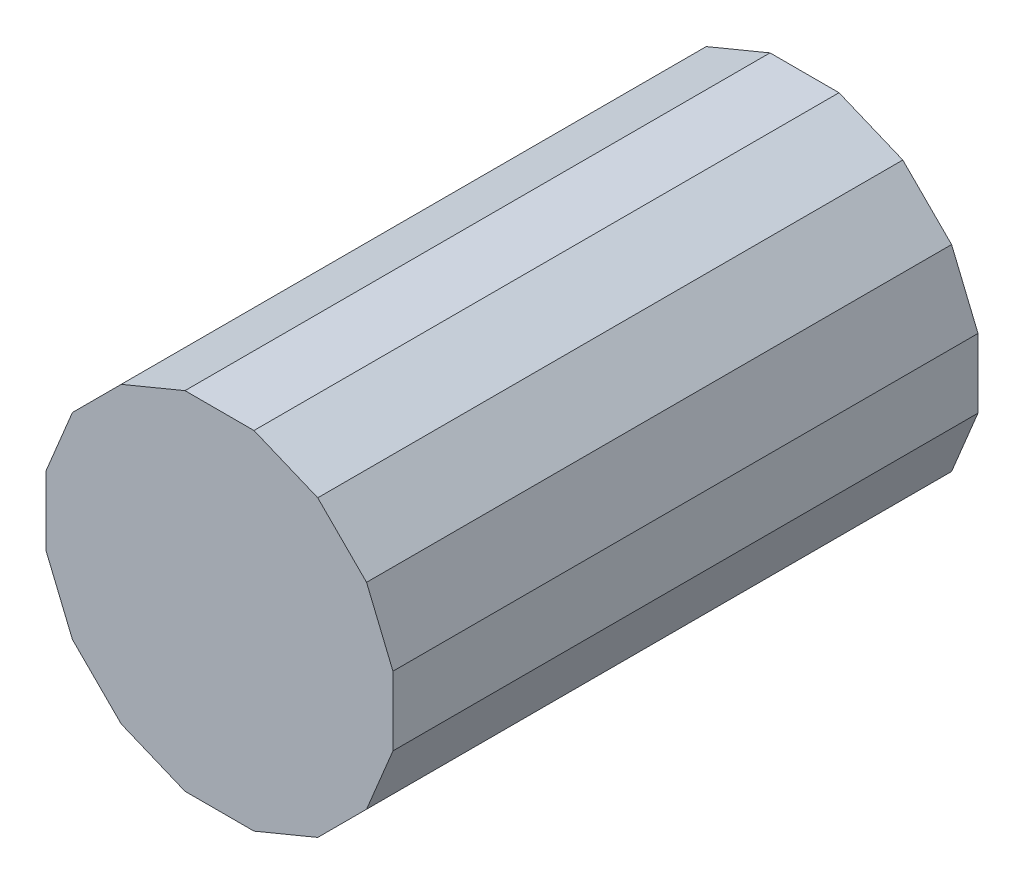
ISO-10303-21;
HEADER;
FILE_DESCRIPTION(('STEP AP214'),'2;1');
FILE_NAME('part.step','',(''),(''),'','','');
FILE_SCHEMA(('AUTOMOTIVE_DESIGN { 1 0 10303 214 1 1 1 1 }'));
ENDSEC;
DATA;
#1=APPLICATION_CONTEXT('core data for automotive mechanical design processes');
#2=APPLICATION_PROTOCOL_DEFINITION('international standard','automotive_design',2000,#1);
#3=PRODUCT_CONTEXT('',#1,'mechanical');
#4=PRODUCT('Part','Part','',(#3));
#5=PRODUCT_RELATED_PRODUCT_CATEGORY('part','',(#4));
#6=PRODUCT_DEFINITION_FORMATION('','',#4);
#7=PRODUCT_DEFINITION_CONTEXT('part definition',#1,'design');
#8=PRODUCT_DEFINITION('design','',#6,#7);
#9=PRODUCT_DEFINITION_SHAPE('','',#8);
#10=(LENGTH_UNIT() NAMED_UNIT(*) SI_UNIT(.MILLI.,.METRE.));
#11=(NAMED_UNIT(*) PLANE_ANGLE_UNIT() SI_UNIT($,.RADIAN.));
#12=(NAMED_UNIT(*) SI_UNIT($,.STERADIAN.) SOLID_ANGLE_UNIT());
#13=UNCERTAINTY_MEASURE_WITH_UNIT(LENGTH_MEASURE(1.E-05),#10,'distance_accuracy_value','');
#14=(GEOMETRIC_REPRESENTATION_CONTEXT(3) GLOBAL_UNCERTAINTY_ASSIGNED_CONTEXT((#13)) GLOBAL_UNIT_ASSIGNED_CONTEXT((#10,
#11,#12)) REPRESENTATION_CONTEXT('',''));
#15=CARTESIAN_POINT('',(0.,0.,0.));
#16=DIRECTION('',(0.,0.,1.));
#17=DIRECTION('',(1.,0.,0.));
#18=AXIS2_PLACEMENT_3D('',#15,#16,#17);
#19=CARTESIAN_POINT('',(-6.703377361718E-07,-6.703377413164E-07,1.00999798));
#20=DIRECTION('',(0.,0.,-1.));
#21=DIRECTION('',(-1.,0.,0.));
#22=AXIS2_PLACEMENT_3D('',#19,#20,#21);
#23=PLANE('',#22);
#24=DIRECTION('',(0.923885359866117,0.382669363583049,0.));
#25=VECTOR('',#24,1.);
#26=CARTESIAN_POINT('',(0.1696466,-0.2538984,1.00999798));
#27=LINE('',#26,#25);
#28=CARTESIAN_POINT('',(0.1696466,-0.2538984,1.00999798));
#29=VERTEX_POINT('',#28);
#30=CARTESIAN_POINT('',(0.0595706200000009,-0.299491400000002,1.00999798));
#31=VERTEX_POINT('',#30);
#32=EDGE_CURVE('E157',#29,#31,#27,.F.);
#33=ORIENTED_EDGE('',*,*,#32,.F.);
#34=DIRECTION('',(0.707106781186548,0.707106781186548,0.));
#35=VECTOR('',#34,1.);
#36=CARTESIAN_POINT('',(0.25389586,-0.16964914,1.00999798));
#37=LINE('',#36,#35);
#38=CARTESIAN_POINT('',(0.253895859999986,-0.169649139999994,1.00999798));
#39=VERTEX_POINT('',#38);
#40=EDGE_CURVE('E162',#39,#29,#37,.F.);
#41=ORIENTED_EDGE('',*,*,#40,.F.);
#42=DIRECTION('',(0.382687560176932,0.923877822704835,0.));
#43=VECTOR('',#42,1.);
#44=CARTESIAN_POINT('',(0.2994914,-0.05957316000001,1.00999798));
#45=LINE('',#44,#43);
#46=CARTESIAN_POINT('',(0.2994914,-0.05957316000001,1.00999798));
#47=VERTEX_POINT('',#46);
#48=EDGE_CURVE('E167',#47,#39,#45,.F.);
#49=ORIENTED_EDGE('',*,*,#48,.F.);
#50=DIRECTION('',(0.,1.,0.));
#51=VECTOR('',#50,1.);
#52=CARTESIAN_POINT('',(0.2994914,0.,1.00999798));
#53=LINE('',#52,#51);
#54=CARTESIAN_POINT('',(0.299491400000015,0.0595706200000064,1.00999798));
#55=VERTEX_POINT('',#54);
#56=EDGE_CURVE('E172',#55,#47,#53,.F.);
#57=ORIENTED_EDGE('',*,*,#56,.F.);
#58=DIRECTION('',(-0.382687560176932,0.923877822704835,0.));
#59=VECTOR('',#58,1.);
#60=CARTESIAN_POINT('',(0.25389586,0.1696466,1.00999798));
#61=LINE('',#60,#59);
#62=CARTESIAN_POINT('',(0.25389586,0.1696466,1.00999798));
#63=VERTEX_POINT('',#62);
#64=EDGE_CURVE('E177',#63,#55,#61,.F.);
#65=ORIENTED_EDGE('',*,*,#64,.F.);
#66=DIRECTION('',(-0.707106781186548,0.707106781186548,0.));
#67=VECTOR('',#66,1.);
#68=CARTESIAN_POINT('',(0.1696466,0.25389586,1.00999798));
#69=LINE('',#68,#67);
#70=CARTESIAN_POINT('',(0.169646599999994,0.253895859999984,1.00999798));
#71=VERTEX_POINT('',#70);
#72=EDGE_CURVE('E183',#71,#63,#69,.F.);
#73=ORIENTED_EDGE('',*,*,#72,.F.);
#74=DIRECTION('',(-0.923877822704835,0.382687560176932,0.));
#75=VECTOR('',#74,1.);
#76=CARTESIAN_POINT('',(0.05957062,0.2994914,1.00999798));
#77=LINE('',#76,#75);
#78=CARTESIAN_POINT('',(0.05957062,0.2994914,1.00999798));
#79=VERTEX_POINT('',#78);
#80=EDGE_CURVE('E188',#79,#71,#77,.F.);
#81=ORIENTED_EDGE('',*,*,#80,.F.);
#82=DIRECTION('',(1.,0.,0.));
#83=VECTOR('',#82,1.);
#84=CARTESIAN_POINT('',(0.,0.2994914,1.00999798));
#85=LINE('',#84,#83);
#86=CARTESIAN_POINT('',(-0.0595731600000157,0.299491400000014,1.00999798));
#87=VERTEX_POINT('',#86);
#88=EDGE_CURVE('E193',#87,#79,#85,.T.);
#89=ORIENTED_EDGE('',*,*,#88,.F.);
#90=DIRECTION('',(-0.923877822704835,-0.382687560176932,0.));
#91=VECTOR('',#90,1.);
#92=CARTESIAN_POINT('',(-0.16964914,0.25389586,1.00999798));
#93=LINE('',#92,#91);
#94=CARTESIAN_POINT('',(-0.16964914,0.25389586,1.00999798));
#95=VERTEX_POINT('',#94);
#96=EDGE_CURVE('E198',#95,#87,#93,.F.);
#97=ORIENTED_EDGE('',*,*,#96,.F.);
#98=DIRECTION('',(-0.707106781186548,-0.707106781186548,0.));
#99=VECTOR('',#98,1.);
#100=CARTESIAN_POINT('',(-0.2538984,0.1696466,1.00999798));
#101=LINE('',#100,#99);
#102=CARTESIAN_POINT('',(-0.253898399999998,0.169646599999999,1.00999798));
#103=VERTEX_POINT('',#102);
#104=EDGE_CURVE('E204',#103,#95,#101,.F.);
#105=ORIENTED_EDGE('',*,*,#104,.F.);
#106=DIRECTION('',(-0.382669363583049,-0.923885359866117,0.));
#107=VECTOR('',#106,1.);
#108=CARTESIAN_POINT('',(-0.2994914,0.05957062,1.00999798));
#109=LINE('',#108,#107);
#110=CARTESIAN_POINT('',(-0.2994914,0.05957062,1.00999798));
#111=VERTEX_POINT('',#110);
#112=EDGE_CURVE('E209',#111,#103,#109,.F.);
#113=ORIENTED_EDGE('',*,*,#112,.F.);
#114=DIRECTION('',(0.,1.,0.));
#115=VECTOR('',#114,1.);
#116=CARTESIAN_POINT('',(-0.2994914,0.,1.00999798));
#117=LINE('',#116,#115);
#118=CARTESIAN_POINT('',(-0.2994914,-0.0595731600000101,1.00999798));
#119=VERTEX_POINT('',#118);
#120=EDGE_CURVE('E214',#119,#111,#117,.T.);
#121=ORIENTED_EDGE('',*,*,#120,.F.);
#122=DIRECTION('',(0.382669363583049,-0.923885359866117,0.));
#123=VECTOR('',#122,1.);
#124=CARTESIAN_POINT('',(-0.2538984,-0.16964914,1.00999798));
#125=LINE('',#124,#123);
#126=CARTESIAN_POINT('',(-0.2538984,-0.16964914,1.00999798));
#127=VERTEX_POINT('',#126);
#128=EDGE_CURVE('E219',#127,#119,#125,.F.);
#129=ORIENTED_EDGE('',*,*,#128,.F.);
#130=DIRECTION('',(0.707106781186548,-0.707106781186548,0.));
#131=VECTOR('',#130,1.);
#132=CARTESIAN_POINT('',(-0.16964914,-0.2538984,1.00999798));
#133=LINE('',#132,#131);
#134=CARTESIAN_POINT('',(-0.16964914,-0.2538984,1.00999798));
#135=VERTEX_POINT('',#134);
#136=EDGE_CURVE('E139',#135,#127,#133,.F.);
#137=ORIENTED_EDGE('',*,*,#136,.F.);
#138=DIRECTION('',(0.923885359866117,-0.382669363583049,0.));
#139=VECTOR('',#138,1.);
#140=CARTESIAN_POINT('',(-0.05957316000001,-0.2994914,1.00999798));
#141=LINE('',#140,#139);
#142=CARTESIAN_POINT('',(-0.05957316000001,-0.2994914,1.00999798));
#143=VERTEX_POINT('',#142);
#144=EDGE_CURVE('E127',#143,#135,#141,.F.);
#145=ORIENTED_EDGE('',*,*,#144,.F.);
#146=DIRECTION('',(1.,0.,0.));
#147=VECTOR('',#146,1.);
#148=CARTESIAN_POINT('',(0.05957062,-0.2994914,1.00999798));
#149=LINE('',#148,#147);
#150=EDGE_CURVE('E131',#31,#143,#149,.F.);
#151=ORIENTED_EDGE('',*,*,#150,.F.);
#152=EDGE_LOOP('',(#33,#41,#49,#57,#65,#73,#81,#89,#97,#105,#113,#121,#129,#137,#145,#151));
#153=FACE_BOUND('',#152,.T.);
#154=ADVANCED_FACE('F17',(#153),#23,.F.);
#155=CARTESIAN_POINT('',(-0.05957316000001,-0.2994914,0.));
#156=DIRECTION('',(-0.382669363583049,-0.923885359866117,0.));
#157=DIRECTION('',(0.923885359866117,-0.382669363583049,0.));
#158=AXIS2_PLACEMENT_3D('',#155,#156,#157);
#159=PLANE('',#158);
#160=DIRECTION('',(0.,0.,1.));
#161=VECTOR('',#160,1.);
#162=CARTESIAN_POINT('',(-0.16964914,-0.2538984,0.));
#163=LINE('',#162,#161);
#164=CARTESIAN_POINT('',(-0.16964914,-0.2538984,0.));
#165=VERTEX_POINT('',#164);
#166=EDGE_CURVE('E141',#165,#135,#163,.T.);
#167=ORIENTED_EDGE('',*,*,#166,.F.);
#168=DIRECTION('',(-0.923885359866119,0.382669363583043,0.));
#169=VECTOR('',#168,1.);
#170=CARTESIAN_POINT('',(-0.05957316000001,-0.2994914,0.));
#171=LINE('',#170,#169);
#172=CARTESIAN_POINT('',(-0.05957316000001,-0.2994914,0.));
#173=VERTEX_POINT('',#172);
#174=EDGE_CURVE('E144',#173,#165,#171,.T.);
#175=ORIENTED_EDGE('',*,*,#174,.F.);
#176=DIRECTION('',(0.,0.,1.));
#177=VECTOR('',#176,1.);
#178=CARTESIAN_POINT('',(-0.05957316000001,-0.2994914,0.));
#179=LINE('',#178,#177);
#180=EDGE_CURVE('E20',#173,#143,#179,.T.);
#181=ORIENTED_EDGE('',*,*,#180,.T.);
#182=ORIENTED_EDGE('',*,*,#144,.T.);
#183=EDGE_LOOP('',(#167,#175,#181,#182));
#184=FACE_BOUND('',#183,.T.);
#185=ADVANCED_FACE('F142',(#184),#159,.T.);
#186=CARTESIAN_POINT('',(-0.16964914,-0.2538984,0.));
#187=DIRECTION('',(-0.707106781186548,-0.707106781186548,0.));
#188=DIRECTION('',(0.707106781186548,-0.707106781186548,0.));
#189=AXIS2_PLACEMENT_3D('',#186,#187,#188);
#190=PLANE('',#189);
#191=DIRECTION('',(0.,0.,1.));
#192=VECTOR('',#191,1.);
#193=CARTESIAN_POINT('',(-0.2538984,-0.16964914,0.));
#194=LINE('',#193,#192);
#195=CARTESIAN_POINT('',(-0.2538984,-0.16964914,0.));
#196=VERTEX_POINT('',#195);
#197=EDGE_CURVE('E222',#196,#127,#194,.T.);
#198=ORIENTED_EDGE('',*,*,#197,.F.);
#199=DIRECTION('',(-0.707106781186547,0.707106781186547,0.));
#200=VECTOR('',#199,1.);
#201=CARTESIAN_POINT('',(-0.16964914,-0.2538984,0.));
#202=LINE('',#201,#200);
#203=EDGE_CURVE('E148',#165,#196,#202,.T.);
#204=ORIENTED_EDGE('',*,*,#203,.F.);
#205=ORIENTED_EDGE('',*,*,#166,.T.);
#206=ORIENTED_EDGE('',*,*,#136,.T.);
#207=EDGE_LOOP('',(#198,#204,#205,#206));
#208=FACE_BOUND('',#207,.T.);
#209=ADVANCED_FACE('F227',(#208),#190,.T.);
#210=CARTESIAN_POINT('',(-0.2538984,-0.16964914,0.));
#211=DIRECTION('',(-0.923885359866117,-0.382669363583049,0.));
#212=DIRECTION('',(0.382669363583049,-0.923885359866117,0.));
#213=AXIS2_PLACEMENT_3D('',#210,#211,#212);
#214=PLANE('',#213);
#215=DIRECTION('',(0.,0.,1.));
#216=VECTOR('',#215,1.);
#217=CARTESIAN_POINT('',(-0.2994914,-0.05957316000001,0.));
#218=LINE('',#217,#216);
#219=CARTESIAN_POINT('',(-0.2994914,-0.0595731600000101,0.));
#220=VERTEX_POINT('',#219);
#221=EDGE_CURVE('E216',#220,#119,#218,.T.);
#222=ORIENTED_EDGE('',*,*,#221,.F.);
#223=DIRECTION('',(-0.382669363583043,0.923885359866119,0.));
#224=VECTOR('',#223,1.);
#225=CARTESIAN_POINT('',(-0.2538984,-0.16964914,0.));
#226=LINE('',#225,#224);
#227=EDGE_CURVE('E230',#196,#220,#226,.T.);
#228=ORIENTED_EDGE('',*,*,#227,.F.);
#229=ORIENTED_EDGE('',*,*,#197,.T.);
#230=ORIENTED_EDGE('',*,*,#128,.T.);
#231=EDGE_LOOP('',(#222,#228,#229,#230));
#232=FACE_BOUND('',#231,.T.);
#233=ADVANCED_FACE('F307',(#232),#214,.T.);
#234=CARTESIAN_POINT('',(-0.2994914,0.,0.));
#235=DIRECTION('',(-1.,0.,0.));
#236=DIRECTION('',(0.,0.,1.));
#237=AXIS2_PLACEMENT_3D('',#234,#235,#236);
#238=PLANE('',#237);
#239=DIRECTION('',(0.,0.,1.));
#240=VECTOR('',#239,1.);
#241=CARTESIAN_POINT('',(-0.2994914,0.05957062,0.));
#242=LINE('',#241,#240);
#243=CARTESIAN_POINT('',(-0.2994914,0.05957062,0.));
#244=VERTEX_POINT('',#243);
#245=EDGE_CURVE('E211',#244,#111,#242,.T.);
#246=ORIENTED_EDGE('',*,*,#245,.F.);
#247=DIRECTION('',(0.,1.,0.));
#248=VECTOR('',#247,1.);
#249=CARTESIAN_POINT('',(-0.2994914,-6.703377413164E-07,0.));
#250=LINE('',#249,#248);
#251=EDGE_CURVE('E231',#220,#244,#250,.T.);
#252=ORIENTED_EDGE('',*,*,#251,.F.);
#253=ORIENTED_EDGE('',*,*,#221,.T.);
#254=ORIENTED_EDGE('',*,*,#120,.T.);
#255=EDGE_LOOP('',(#246,#252,#253,#254));
#256=FACE_BOUND('',#255,.T.);
#257=ADVANCED_FACE('F305',(#256),#238,.T.);
#258=CARTESIAN_POINT('',(-0.2994914,0.05957062,0.));
#259=DIRECTION('',(-0.923885359866117,0.382669363583049,0.));
#260=DIRECTION('',(-0.382669363583049,-0.923885359866117,0.));
#261=AXIS2_PLACEMENT_3D('',#258,#259,#260);
#262=PLANE('',#261);
#263=DIRECTION('',(0.,0.,1.));
#264=VECTOR('',#263,1.);
#265=CARTESIAN_POINT('',(-0.2538984,0.1696466,0.));
#266=LINE('',#265,#264);
#267=CARTESIAN_POINT('',(-0.253898399999998,0.169646599999999,0.));
#268=VERTEX_POINT('',#267);
#269=EDGE_CURVE('E206',#268,#103,#266,.T.);
#270=ORIENTED_EDGE('',*,*,#269,.F.);
#271=DIRECTION('',(0.382669363583013,0.923885359866132,0.));
#272=VECTOR('',#271,1.);
#273=CARTESIAN_POINT('',(-0.2994914,0.05957062,0.));
#274=LINE('',#273,#272);
#275=EDGE_CURVE('E235',#244,#268,#274,.T.);
#276=ORIENTED_EDGE('',*,*,#275,.F.);
#277=ORIENTED_EDGE('',*,*,#245,.T.);
#278=ORIENTED_EDGE('',*,*,#112,.T.);
#279=EDGE_LOOP('',(#270,#276,#277,#278));
#280=FACE_BOUND('',#279,.T.);
#281=ADVANCED_FACE('F302',(#280),#262,.T.);
#282=CARTESIAN_POINT('',(-0.2538984,0.1696466,0.));
#283=DIRECTION('',(-0.707106781186548,0.707106781186548,0.));
#284=DIRECTION('',(-0.707106781186548,-0.707106781186548,0.));
#285=AXIS2_PLACEMENT_3D('',#282,#283,#284);
#286=PLANE('',#285);
#287=DIRECTION('',(0.,0.,1.));
#288=VECTOR('',#287,1.);
#289=CARTESIAN_POINT('',(-0.16964914,0.25389586,0.));
#290=LINE('',#289,#288);
#291=CARTESIAN_POINT('',(-0.16964914,0.25389586,0.));
#292=VERTEX_POINT('',#291);
#293=EDGE_CURVE('E201',#292,#95,#290,.T.);
#294=ORIENTED_EDGE('',*,*,#293,.F.);
#295=DIRECTION('',(0.707106781186548,0.707106781186547,0.));
#296=VECTOR('',#295,1.);
#297=CARTESIAN_POINT('',(-0.2538984,0.1696466,0.));
#298=LINE('',#297,#296);
#299=EDGE_CURVE('E238',#268,#292,#298,.T.);
#300=ORIENTED_EDGE('',*,*,#299,.F.);
#301=ORIENTED_EDGE('',*,*,#269,.T.);
#302=ORIENTED_EDGE('',*,*,#104,.T.);
#303=EDGE_LOOP('',(#294,#300,#301,#302));
#304=FACE_BOUND('',#303,.T.);
#305=ADVANCED_FACE('F297',(#304),#286,.T.);
#306=CARTESIAN_POINT('',(-0.16964914,0.25389586,0.));
#307=DIRECTION('',(-0.382687560176932,0.923877822704835,0.));
#308=DIRECTION('',(-0.923877822704835,-0.382687560176932,0.));
#309=AXIS2_PLACEMENT_3D('',#306,#307,#308);
#310=PLANE('',#309);
#311=DIRECTION('',(0.,0.,1.));
#312=VECTOR('',#311,1.);
#313=CARTESIAN_POINT('',(-0.05957316000001,0.2994914,0.));
#314=LINE('',#313,#312);
#315=CARTESIAN_POINT('',(-0.0595731600000157,0.299491400000014,0.));
#316=VERTEX_POINT('',#315);
#317=EDGE_CURVE('E195',#316,#87,#314,.T.);
#318=ORIENTED_EDGE('',*,*,#317,.F.);
#319=DIRECTION('',(0.923877822704931,0.382687560176702,0.));
#320=VECTOR('',#319,1.);
#321=CARTESIAN_POINT('',(-0.16964914,0.25389586,0.));
#322=LINE('',#321,#320);
#323=EDGE_CURVE('E241',#292,#316,#322,.T.);
#324=ORIENTED_EDGE('',*,*,#323,.F.);
#325=ORIENTED_EDGE('',*,*,#293,.T.);
#326=ORIENTED_EDGE('',*,*,#96,.T.);
#327=EDGE_LOOP('',(#318,#324,#325,#326));
#328=FACE_BOUND('',#327,.T.);
#329=ADVANCED_FACE('F293',(#328),#310,.T.);
#330=CARTESIAN_POINT('',(0.,0.2994914,0.));
#331=DIRECTION('',(0.,1.,0.));
#332=DIRECTION('',(0.,0.,1.));
#333=AXIS2_PLACEMENT_3D('',#330,#331,#332);
#334=PLANE('',#333);
#335=DIRECTION('',(0.,0.,1.));
#336=VECTOR('',#335,1.);
#337=CARTESIAN_POINT('',(0.05957062,0.2994914,0.));
#338=LINE('',#337,#336);
#339=CARTESIAN_POINT('',(0.05957062,0.2994914,0.));
#340=VERTEX_POINT('',#339);
#341=EDGE_CURVE('E190',#340,#79,#338,.T.);
#342=ORIENTED_EDGE('',*,*,#341,.F.);
#343=DIRECTION('',(-1.,0.,0.));
#344=VECTOR('',#343,1.);
#345=CARTESIAN_POINT('',(-6.703377361718E-07,0.2994914,0.));
#346=LINE('',#345,#344);
#347=EDGE_CURVE('E244',#316,#340,#346,.F.);
#348=ORIENTED_EDGE('',*,*,#347,.F.);
#349=ORIENTED_EDGE('',*,*,#317,.T.);
#350=ORIENTED_EDGE('',*,*,#88,.T.);
#351=EDGE_LOOP('',(#342,#348,#349,#350));
#352=FACE_BOUND('',#351,.T.);
#353=ADVANCED_FACE('F289',(#352),#334,.T.);
#354=CARTESIAN_POINT('',(0.05957062,0.2994914,0.));
#355=DIRECTION('',(0.382687560176932,0.923877822704835,0.));
#356=DIRECTION('',(-0.923877822704835,0.382687560176932,0.));
#357=AXIS2_PLACEMENT_3D('',#354,#355,#356);
#358=PLANE('',#357);
#359=DIRECTION('',(0.,0.,1.));
#360=VECTOR('',#359,1.);
#361=CARTESIAN_POINT('',(0.1696466,0.25389586,0.));
#362=LINE('',#361,#360);
#363=CARTESIAN_POINT('',(0.169646599999994,0.253895859999984,0.));
#364=VERTEX_POINT('',#363);
#365=EDGE_CURVE('E185',#364,#71,#362,.T.);
#366=ORIENTED_EDGE('',*,*,#365,.F.);
#367=DIRECTION('',(0.923877822704943,-0.382687560176672,0.));
#368=VECTOR('',#367,1.);
#369=CARTESIAN_POINT('',(0.05957062,0.2994914,0.));
#370=LINE('',#369,#368);
#371=EDGE_CURVE('E246',#340,#364,#370,.T.);
#372=ORIENTED_EDGE('',*,*,#371,.F.);
#373=ORIENTED_EDGE('',*,*,#341,.T.);
#374=ORIENTED_EDGE('',*,*,#80,.T.);
#375=EDGE_LOOP('',(#366,#372,#373,#374));
#376=FACE_BOUND('',#375,.T.);
#377=ADVANCED_FACE('F285',(#376),#358,.T.);
#378=CARTESIAN_POINT('',(0.1696466,0.25389586,0.));
#379=DIRECTION('',(0.707106781186548,0.707106781186548,0.));
#380=DIRECTION('',(-0.707106781186548,0.707106781186548,0.));
#381=AXIS2_PLACEMENT_3D('',#378,#379,#380);
#382=PLANE('',#381);
#383=DIRECTION('',(0.,0.,1.));
#384=VECTOR('',#383,1.);
#385=CARTESIAN_POINT('',(0.25389586,0.1696466,0.));
#386=LINE('',#385,#384);
#387=CARTESIAN_POINT('',(0.25389586,0.1696466,0.));
#388=VERTEX_POINT('',#387);
#389=EDGE_CURVE('E180',#388,#63,#386,.T.);
#390=ORIENTED_EDGE('',*,*,#389,.F.);
#391=DIRECTION('',(0.707106781186547,-0.707106781186547,0.));
#392=VECTOR('',#391,1.);
#393=CARTESIAN_POINT('',(0.1696466,0.25389586,0.));
#394=LINE('',#393,#392);
#395=EDGE_CURVE('E249',#364,#388,#394,.T.);
#396=ORIENTED_EDGE('',*,*,#395,.F.);
#397=ORIENTED_EDGE('',*,*,#365,.T.);
#398=ORIENTED_EDGE('',*,*,#72,.T.);
#399=EDGE_LOOP('',(#390,#396,#397,#398));
#400=FACE_BOUND('',#399,.T.);
#401=ADVANCED_FACE('F282',(#400),#382,.T.);
#402=CARTESIAN_POINT('',(0.25389586,0.1696466,0.));
#403=DIRECTION('',(0.923877822704835,0.382687560176932,0.));
#404=DIRECTION('',(-0.382687560176932,0.923877822704835,0.));
#405=AXIS2_PLACEMENT_3D('',#402,#403,#404);
#406=PLANE('',#405);
#407=DIRECTION('',(0.,0.,-1.));
#408=VECTOR('',#407,1.);
#409=CARTESIAN_POINT('',(0.2994914,0.05957062,0.));
#410=LINE('',#409,#408);
#411=CARTESIAN_POINT('',(0.299491400000015,0.0595706200000064,0.));
#412=VERTEX_POINT('',#411);
#413=EDGE_CURVE('E174',#412,#55,#410,.F.);
#414=ORIENTED_EDGE('',*,*,#413,.F.);
#415=DIRECTION('',(0.382687560176672,-0.923877822704943,0.));
#416=VECTOR('',#415,1.);
#417=CARTESIAN_POINT('',(0.25389586,0.1696466,0.));
#418=LINE('',#417,#416);
#419=EDGE_CURVE('E252',#388,#412,#418,.T.);
#420=ORIENTED_EDGE('',*,*,#419,.F.);
#421=ORIENTED_EDGE('',*,*,#389,.T.);
#422=ORIENTED_EDGE('',*,*,#64,.T.);
#423=EDGE_LOOP('',(#414,#420,#421,#422));
#424=FACE_BOUND('',#423,.T.);
#425=ADVANCED_FACE('F277',(#424),#406,.T.);
#426=CARTESIAN_POINT('',(0.2994914,0.,0.));
#427=DIRECTION('',(1.,0.,0.));
#428=DIRECTION('',(0.,0.,-1.));
#429=AXIS2_PLACEMENT_3D('',#426,#427,#428);
#430=PLANE('',#429);
#431=DIRECTION('',(0.,0.,1.));
#432=VECTOR('',#431,1.);
#433=CARTESIAN_POINT('',(0.2994914,-0.05957316000001,0.));
#434=LINE('',#433,#432);
#435=CARTESIAN_POINT('',(0.2994914,-0.05957316000001,0.));
#436=VERTEX_POINT('',#435);
#437=EDGE_CURVE('E169',#436,#47,#434,.T.);
#438=ORIENTED_EDGE('',*,*,#437,.F.);
#439=DIRECTION('',(0.,1.,0.));
#440=VECTOR('',#439,1.);
#441=CARTESIAN_POINT('',(0.2994914,-6.703377413164E-07,0.));
#442=LINE('',#441,#440);
#443=EDGE_CURVE('E255',#412,#436,#442,.F.);
#444=ORIENTED_EDGE('',*,*,#443,.F.);
#445=ORIENTED_EDGE('',*,*,#413,.T.);
#446=ORIENTED_EDGE('',*,*,#56,.T.);
#447=EDGE_LOOP('',(#438,#444,#445,#446));
#448=FACE_BOUND('',#447,.T.);
#449=ADVANCED_FACE('F274',(#448),#430,.T.);
#450=CARTESIAN_POINT('',(0.2994914,-0.05957316000001,0.));
#451=DIRECTION('',(0.923877822704835,-0.382687560176932,0.));
#452=DIRECTION('',(0.382687560176932,0.923877822704835,0.));
#453=AXIS2_PLACEMENT_3D('',#450,#451,#452);
#454=PLANE('',#453);
#455=DIRECTION('',(0.,0.,1.));
#456=VECTOR('',#455,1.);
#457=CARTESIAN_POINT('',(0.25389586,-0.16964914,0.));
#458=LINE('',#457,#456);
#459=CARTESIAN_POINT('',(0.253895859999986,-0.169649139999994,0.));
#460=VERTEX_POINT('',#459);
#461=EDGE_CURVE('E164',#460,#39,#458,.T.);
#462=ORIENTED_EDGE('',*,*,#461,.F.);
#463=DIRECTION('',(-0.382687560176702,-0.923877822704931,0.));
#464=VECTOR('',#463,1.);
#465=CARTESIAN_POINT('',(0.2994914,-0.05957316000001,0.));
#466=LINE('',#465,#464);
#467=EDGE_CURVE('E257',#436,#460,#466,.T.);
#468=ORIENTED_EDGE('',*,*,#467,.F.);
#469=ORIENTED_EDGE('',*,*,#437,.T.);
#470=ORIENTED_EDGE('',*,*,#48,.T.);
#471=EDGE_LOOP('',(#462,#468,#469,#470));
#472=FACE_BOUND('',#471,.T.);
#473=ADVANCED_FACE('F271',(#472),#454,.T.);
#474=CARTESIAN_POINT('',(0.25389586,-0.16964914,0.));
#475=DIRECTION('',(0.707106781186548,-0.707106781186548,0.));
#476=DIRECTION('',(0.707106781186548,0.707106781186548,0.));
#477=AXIS2_PLACEMENT_3D('',#474,#475,#476);
#478=PLANE('',#477);
#479=DIRECTION('',(0.,0.,1.));
#480=VECTOR('',#479,1.);
#481=CARTESIAN_POINT('',(0.1696466,-0.2538984,0.));
#482=LINE('',#481,#480);
#483=CARTESIAN_POINT('',(0.1696466,-0.2538984,0.));
#484=VERTEX_POINT('',#483);
#485=EDGE_CURVE('E159',#484,#29,#482,.T.);
#486=ORIENTED_EDGE('',*,*,#485,.F.);
#487=DIRECTION('',(-0.707106781186547,-0.707106781186548,0.));
#488=VECTOR('',#487,1.);
#489=CARTESIAN_POINT('',(0.25389586,-0.16964914,0.));
#490=LINE('',#489,#488);
#491=EDGE_CURVE('E26',#460,#484,#490,.T.);
#492=ORIENTED_EDGE('',*,*,#491,.F.);
#493=ORIENTED_EDGE('',*,*,#461,.T.);
#494=ORIENTED_EDGE('',*,*,#40,.T.);
#495=EDGE_LOOP('',(#486,#492,#493,#494));
#496=FACE_BOUND('',#495,.T.);
#497=ADVANCED_FACE('F263',(#496),#478,.T.);
#498=CARTESIAN_POINT('',(0.1696466,-0.2538984,0.));
#499=DIRECTION('',(0.382669363583049,-0.923885359866117,0.));
#500=DIRECTION('',(0.923885359866117,0.382669363583049,0.));
#501=AXIS2_PLACEMENT_3D('',#498,#499,#500);
#502=PLANE('',#501);
#503=DIRECTION('',(0.,0.,-1.));
#504=VECTOR('',#503,1.);
#505=CARTESIAN_POINT('',(0.05957062,-0.2994914,0.));
#506=LINE('',#505,#504);
#507=CARTESIAN_POINT('',(0.0595706200000009,-0.299491400000002,0.));
#508=VERTEX_POINT('',#507);
#509=EDGE_CURVE('E134',#508,#31,#506,.F.);
#510=ORIENTED_EDGE('',*,*,#509,.F.);
#511=DIRECTION('',(-0.923885359866132,-0.382669363583013,0.));
#512=VECTOR('',#511,1.);
#513=CARTESIAN_POINT('',(0.1696466,-0.2538984,0.));
#514=LINE('',#513,#512);
#515=EDGE_CURVE('E11',#484,#508,#514,.T.);
#516=ORIENTED_EDGE('',*,*,#515,.F.);
#517=ORIENTED_EDGE('',*,*,#485,.T.);
#518=ORIENTED_EDGE('',*,*,#32,.T.);
#519=EDGE_LOOP('',(#510,#516,#517,#518));
#520=FACE_BOUND('',#519,.T.);
#521=ADVANCED_FACE('F266',(#520),#502,.T.);
#522=CARTESIAN_POINT('',(0.05957062,-0.2994914,0.));
#523=DIRECTION('',(0.,-1.,0.));
#524=DIRECTION('',(0.,0.,-1.));
#525=AXIS2_PLACEMENT_3D('',#522,#523,#524);
#526=PLANE('',#525);
#527=ORIENTED_EDGE('',*,*,#150,.T.);
#528=ORIENTED_EDGE('',*,*,#180,.F.);
#529=DIRECTION('',(-1.,0.,0.));
#530=VECTOR('',#529,1.);
#531=CARTESIAN_POINT('',(-6.703377361718E-07,-0.2994914,0.));
#532=LINE('',#531,#530);
#533=EDGE_CURVE('E35',#508,#173,#532,.T.);
#534=ORIENTED_EDGE('',*,*,#533,.F.);
#535=ORIENTED_EDGE('',*,*,#509,.T.);
#536=EDGE_LOOP('',(#527,#528,#534,#535));
#537=FACE_BOUND('',#536,.T.);
#538=ADVANCED_FACE('F132',(#537),#526,.T.);
#539=CARTESIAN_POINT('',(-6.703377361718E-07,-6.703377413164E-07,0.));
#540=DIRECTION('',(0.,0.,-1.));
#541=DIRECTION('',(-1.,0.,0.));
#542=AXIS2_PLACEMENT_3D('',#539,#540,#541);
#543=PLANE('',#542);
#544=ORIENTED_EDGE('',*,*,#515,.T.);
#545=ORIENTED_EDGE('',*,*,#533,.T.);
#546=ORIENTED_EDGE('',*,*,#174,.T.);
#547=ORIENTED_EDGE('',*,*,#203,.T.);
#548=ORIENTED_EDGE('',*,*,#227,.T.);
#549=ORIENTED_EDGE('',*,*,#251,.T.);
#550=ORIENTED_EDGE('',*,*,#275,.T.);
#551=ORIENTED_EDGE('',*,*,#299,.T.);
#552=ORIENTED_EDGE('',*,*,#323,.T.);
#553=ORIENTED_EDGE('',*,*,#347,.T.);
#554=ORIENTED_EDGE('',*,*,#371,.T.);
#555=ORIENTED_EDGE('',*,*,#395,.T.);
#556=ORIENTED_EDGE('',*,*,#419,.T.);
#557=ORIENTED_EDGE('',*,*,#443,.T.);
#558=ORIENTED_EDGE('',*,*,#467,.T.);
#559=ORIENTED_EDGE('',*,*,#491,.T.);
#560=EDGE_LOOP('',(#544,#545,#546,#547,#548,#549,#550,#551,#552,#553,#554,#555,#556,#557,#558,#559));
#561=FACE_BOUND('',#560,.T.);
#562=ADVANCED_FACE('F150',(#561),#543,.T.);
#563=CLOSED_SHELL('',(#154,#185,#209,#233,#257,#281,#305,#329,#353,#377,#401,#425,#449,#473,
#497,#521,#538,#562));
#564=MANIFOLD_SOLID_BREP('B1',#563);
#565=ADVANCED_BREP_SHAPE_REPRESENTATION('',(#18,#564),#14);
#566=SHAPE_DEFINITION_REPRESENTATION(#9,#565);
ENDSEC;
END-ISO-10303-21;
